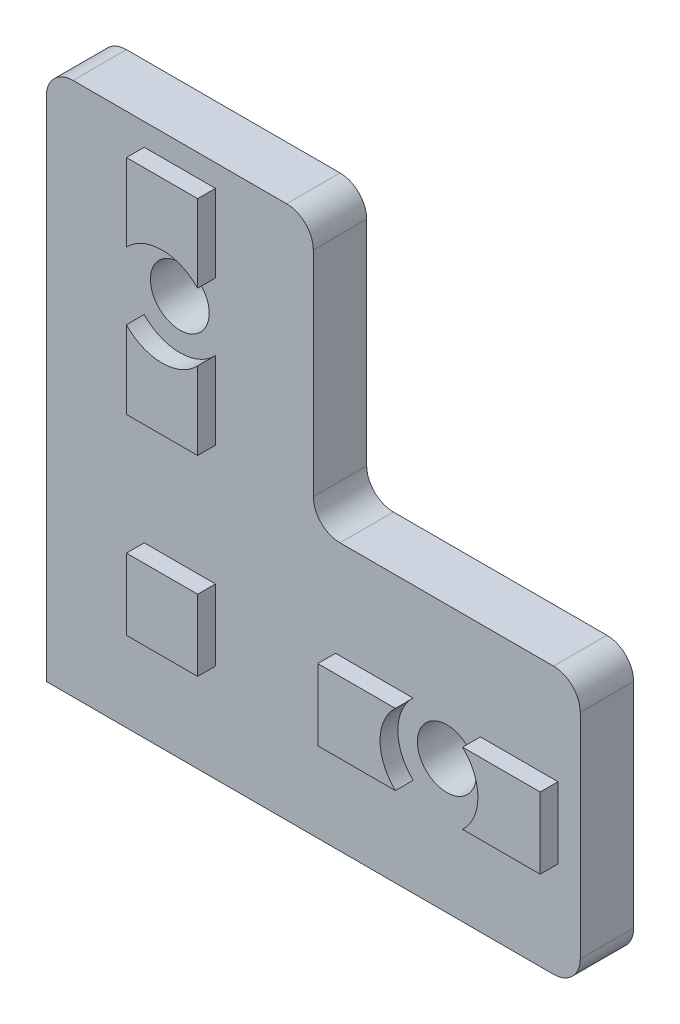
ISO-10303-21;
HEADER;
FILE_DESCRIPTION(('STEP AP214'),'2;1');
FILE_NAME('part.step','',(''),(''),'','','');
FILE_SCHEMA(('AUTOMOTIVE_DESIGN { 1 0 10303 214 1 1 1 1 }'));
ENDSEC;
DATA;
#1=APPLICATION_CONTEXT('core data for automotive mechanical design processes');
#2=APPLICATION_PROTOCOL_DEFINITION('international standard','automotive_design',2000,#1);
#3=PRODUCT_CONTEXT('',#1,'mechanical');
#4=PRODUCT('Part','Part','',(#3));
#5=PRODUCT_RELATED_PRODUCT_CATEGORY('part','',(#4));
#6=PRODUCT_DEFINITION_FORMATION('','',#4);
#7=PRODUCT_DEFINITION_CONTEXT('part definition',#1,'design');
#8=PRODUCT_DEFINITION('design','',#6,#7);
#9=PRODUCT_DEFINITION_SHAPE('','',#8);
#10=(LENGTH_UNIT() NAMED_UNIT(*) SI_UNIT(.MILLI.,.METRE.));
#11=(NAMED_UNIT(*) PLANE_ANGLE_UNIT() SI_UNIT($,.RADIAN.));
#12=(NAMED_UNIT(*) SI_UNIT($,.STERADIAN.) SOLID_ANGLE_UNIT());
#13=UNCERTAINTY_MEASURE_WITH_UNIT(LENGTH_MEASURE(1.E-05),#10,'distance_accuracy_value','');
#14=(GEOMETRIC_REPRESENTATION_CONTEXT(3) GLOBAL_UNCERTAINTY_ASSIGNED_CONTEXT((#13)) GLOBAL_UNIT_ASSIGNED_CONTEXT((#10,
#11,#12)) REPRESENTATION_CONTEXT('',''));
#15=CARTESIAN_POINT('',(0.,0.,0.));
#16=DIRECTION('',(0.,0.,1.));
#17=DIRECTION('',(1.,0.,0.));
#18=AXIS2_PLACEMENT_3D('',#15,#16,#17);
#19=CARTESIAN_POINT('',(0.,57.,6.));
#20=DIRECTION('',(1.,0.,0.));
#21=DIRECTION('',(0.,1.,0.));
#22=AXIS2_PLACEMENT_3D('',#19,#20,#21);
#23=PLANE('',#22);
#24=DIRECTION('',(0.,-1.,0.));
#25=VECTOR('',#24,1.);
#26=CARTESIAN_POINT('',(0.,57.,0.));
#27=LINE('',#26,#25);
#28=CARTESIAN_POINT('',(0.,57.,0.));
#29=VERTEX_POINT('',#28);
#30=CARTESIAN_POINT('',(0.,0.,0.));
#31=VERTEX_POINT('',#30);
#32=EDGE_CURVE('E409',#29,#31,#27,.T.);
#33=ORIENTED_EDGE('',*,*,#32,.T.);
#34=DIRECTION('',(0.,0.,-1.));
#35=VECTOR('',#34,1.);
#36=CARTESIAN_POINT('',(0.,0.,6.));
#37=LINE('',#36,#35);
#38=CARTESIAN_POINT('',(0.,0.,6.));
#39=VERTEX_POINT('',#38);
#40=EDGE_CURVE('E11',#39,#31,#37,.T.);
#41=ORIENTED_EDGE('',*,*,#40,.F.);
#42=DIRECTION('',(0.,-1.,0.));
#43=VECTOR('',#42,1.);
#44=CARTESIAN_POINT('',(0.,57.,6.));
#45=LINE('',#44,#43);
#46=CARTESIAN_POINT('',(0.,57.,6.));
#47=VERTEX_POINT('',#46);
#48=EDGE_CURVE('E410',#47,#39,#45,.T.);
#49=ORIENTED_EDGE('',*,*,#48,.F.);
#50=DIRECTION('',(0.,0.,-1.));
#51=VECTOR('',#50,1.);
#52=CARTESIAN_POINT('',(0.,57.,6.));
#53=LINE('',#52,#51);
#54=EDGE_CURVE('E434',#47,#29,#53,.T.);
#55=ORIENTED_EDGE('',*,*,#54,.T.);
#56=EDGE_LOOP('',(#33,#41,#49,#55));
#57=FACE_BOUND('',#56,.T.);
#58=ADVANCED_FACE('F33',(#57),#23,.F.);
#59=CARTESIAN_POINT('',(0.,0.,6.));
#60=DIRECTION('',(0.,1.,0.));
#61=DIRECTION('',(0.,0.,1.));
#62=AXIS2_PLACEMENT_3D('',#59,#60,#61);
#63=PLANE('',#62);
#64=DIRECTION('',(1.,0.,0.));
#65=VECTOR('',#64,1.);
#66=CARTESIAN_POINT('',(0.,0.,0.));
#67=LINE('',#66,#65);
#68=CARTESIAN_POINT('',(57.,0.,0.));
#69=VERTEX_POINT('',#68);
#70=EDGE_CURVE('E437',#31,#69,#67,.T.);
#71=ORIENTED_EDGE('',*,*,#70,.T.);
#72=DIRECTION('',(0.,0.,-1.));
#73=VECTOR('',#72,1.);
#74=CARTESIAN_POINT('',(57.,0.,6.));
#75=LINE('',#74,#73);
#76=CARTESIAN_POINT('',(57.,0.,6.));
#77=VERTEX_POINT('',#76);
#78=EDGE_CURVE('E40',#77,#69,#75,.T.);
#79=ORIENTED_EDGE('',*,*,#78,.F.);
#80=DIRECTION('',(1.,0.,0.));
#81=VECTOR('',#80,1.);
#82=CARTESIAN_POINT('',(0.,0.,6.));
#83=LINE('',#82,#81);
#84=EDGE_CURVE('E413',#39,#77,#83,.T.);
#85=ORIENTED_EDGE('',*,*,#84,.F.);
#86=ORIENTED_EDGE('',*,*,#40,.T.);
#87=EDGE_LOOP('',(#71,#79,#85,#86));
#88=FACE_BOUND('',#87,.T.);
#89=ADVANCED_FACE('F509',(#88),#63,.F.);
#90=CARTESIAN_POINT('',(57.,3.,6.));
#91=DIRECTION('',(0.,0.,-1.));
#92=DIRECTION('',(-1.,0.,0.));
#93=AXIS2_PLACEMENT_3D('',#90,#91,#92);
#94=CYLINDRICAL_SURFACE('',#93,3.);
#95=CARTESIAN_POINT('',(57.,3.,0.));
#96=DIRECTION('',(0.,0.,1.));
#97=DIRECTION('',(1.,0.,0.));
#98=AXIS2_PLACEMENT_3D('',#95,#96,#97);
#99=CIRCLE('',#98,3.);
#100=CARTESIAN_POINT('',(60.,3.,0.));
#101=VERTEX_POINT('',#100);
#102=EDGE_CURVE('E439',#69,#101,#99,.T.);
#103=ORIENTED_EDGE('',*,*,#102,.T.);
#104=DIRECTION('',(0.,0.,-1.));
#105=VECTOR('',#104,1.);
#106=CARTESIAN_POINT('',(60.,3.,6.));
#107=LINE('',#106,#105);
#108=CARTESIAN_POINT('',(60.,3.,6.));
#109=VERTEX_POINT('',#108);
#110=EDGE_CURVE('E479',#109,#101,#107,.T.);
#111=ORIENTED_EDGE('',*,*,#110,.F.);
#112=CARTESIAN_POINT('',(57.,3.,6.));
#113=DIRECTION('',(0.,0.,1.));
#114=DIRECTION('',(1.,0.,0.));
#115=AXIS2_PLACEMENT_3D('',#112,#113,#114);
#116=CIRCLE('',#115,3.);
#117=EDGE_CURVE('E416',#77,#109,#116,.T.);
#118=ORIENTED_EDGE('',*,*,#117,.F.);
#119=ORIENTED_EDGE('',*,*,#78,.T.);
#120=EDGE_LOOP('',(#103,#111,#118,#119));
#121=FACE_BOUND('',#120,.T.);
#122=ADVANCED_FACE('F486',(#121),#94,.T.);
#123=CARTESIAN_POINT('',(60.,3.00000000000002,6.));
#124=DIRECTION('',(-1.,0.,0.));
#125=DIRECTION('',(0.,0.,1.));
#126=AXIS2_PLACEMENT_3D('',#123,#124,#125);
#127=PLANE('',#126);
#128=DIRECTION('',(0.,1.,0.));
#129=VECTOR('',#128,1.);
#130=CARTESIAN_POINT('',(60.,3.00000000000002,0.));
#131=LINE('',#130,#129);
#132=CARTESIAN_POINT('',(60.,27.,0.));
#133=VERTEX_POINT('',#132);
#134=EDGE_CURVE('E441',#101,#133,#131,.T.);
#135=ORIENTED_EDGE('',*,*,#134,.T.);
#136=DIRECTION('',(0.,0.,-1.));
#137=VECTOR('',#136,1.);
#138=CARTESIAN_POINT('',(60.,27.,6.));
#139=LINE('',#138,#137);
#140=CARTESIAN_POINT('',(60.,27.,6.));
#141=VERTEX_POINT('',#140);
#142=EDGE_CURVE('E476',#141,#133,#139,.T.);
#143=ORIENTED_EDGE('',*,*,#142,.F.);
#144=DIRECTION('',(0.,1.,0.));
#145=VECTOR('',#144,1.);
#146=CARTESIAN_POINT('',(60.,3.00000000000002,6.));
#147=LINE('',#146,#145);
#148=EDGE_CURVE('E418',#109,#141,#147,.T.);
#149=ORIENTED_EDGE('',*,*,#148,.F.);
#150=ORIENTED_EDGE('',*,*,#110,.T.);
#151=EDGE_LOOP('',(#135,#143,#149,#150));
#152=FACE_BOUND('',#151,.T.);
#153=ADVANCED_FACE('F497',(#152),#127,.F.);
#154=CARTESIAN_POINT('',(57.,27.,6.));
#155=DIRECTION('',(0.,0.,-1.));
#156=DIRECTION('',(-1.,0.,0.));
#157=AXIS2_PLACEMENT_3D('',#154,#155,#156);
#158=CYLINDRICAL_SURFACE('',#157,3.);
#159=CARTESIAN_POINT('',(57.,27.,0.));
#160=DIRECTION('',(0.,0.,1.));
#161=DIRECTION('',(1.,0.,0.));
#162=AXIS2_PLACEMENT_3D('',#159,#160,#161);
#163=CIRCLE('',#162,3.);
#164=CARTESIAN_POINT('',(57.,30.,0.));
#165=VERTEX_POINT('',#164);
#166=EDGE_CURVE('E443',#133,#165,#163,.T.);
#167=ORIENTED_EDGE('',*,*,#166,.T.);
#168=DIRECTION('',(0.,0.,-1.));
#169=VECTOR('',#168,1.);
#170=CARTESIAN_POINT('',(57.,30.,6.));
#171=LINE('',#170,#169);
#172=CARTESIAN_POINT('',(57.,30.,6.));
#173=VERTEX_POINT('',#172);
#174=EDGE_CURVE('E473',#173,#165,#171,.T.);
#175=ORIENTED_EDGE('',*,*,#174,.F.);
#176=CARTESIAN_POINT('',(57.,27.,6.));
#177=DIRECTION('',(0.,0.,1.));
#178=DIRECTION('',(1.,0.,0.));
#179=AXIS2_PLACEMENT_3D('',#176,#177,#178);
#180=CIRCLE('',#179,3.);
#181=EDGE_CURVE('E420',#141,#173,#180,.T.);
#182=ORIENTED_EDGE('',*,*,#181,.F.);
#183=ORIENTED_EDGE('',*,*,#142,.T.);
#184=EDGE_LOOP('',(#167,#175,#182,#183));
#185=FACE_BOUND('',#184,.T.);
#186=ADVANCED_FACE('F501',(#185),#158,.T.);
#187=CARTESIAN_POINT('',(57.,30.,6.));
#188=DIRECTION('',(0.,-1.,0.));
#189=DIRECTION('',(1.,0.,0.));
#190=AXIS2_PLACEMENT_3D('',#187,#188,#189);
#191=PLANE('',#190);
#192=DIRECTION('',(-1.,0.,0.));
#193=VECTOR('',#192,1.);
#194=CARTESIAN_POINT('',(57.,30.,0.));
#195=LINE('',#194,#193);
#196=CARTESIAN_POINT('',(33.,30.,0.));
#197=VERTEX_POINT('',#196);
#198=EDGE_CURVE('E445',#165,#197,#195,.T.);
#199=ORIENTED_EDGE('',*,*,#198,.T.);
#200=DIRECTION('',(0.,0.,-1.));
#201=VECTOR('',#200,1.);
#202=CARTESIAN_POINT('',(33.,30.,6.));
#203=LINE('',#202,#201);
#204=CARTESIAN_POINT('',(33.,30.,6.));
#205=VERTEX_POINT('',#204);
#206=EDGE_CURVE('E470',#205,#197,#203,.T.);
#207=ORIENTED_EDGE('',*,*,#206,.F.);
#208=DIRECTION('',(-1.,0.,0.));
#209=VECTOR('',#208,1.);
#210=CARTESIAN_POINT('',(57.,30.,6.));
#211=LINE('',#210,#209);
#212=EDGE_CURVE('E422',#173,#205,#211,.T.);
#213=ORIENTED_EDGE('',*,*,#212,.F.);
#214=ORIENTED_EDGE('',*,*,#174,.T.);
#215=EDGE_LOOP('',(#199,#207,#213,#214));
#216=FACE_BOUND('',#215,.T.);
#217=ADVANCED_FACE('F537',(#216),#191,.F.);
#218=CARTESIAN_POINT('',(33.,33.,6.));
#219=DIRECTION('',(0.,0.,-1.));
#220=DIRECTION('',(-1.,0.,0.));
#221=AXIS2_PLACEMENT_3D('',#218,#219,#220);
#222=CYLINDRICAL_SURFACE('',#221,3.);
#223=CARTESIAN_POINT('',(33.,33.,0.));
#224=DIRECTION('',(0.,0.,-1.));
#225=DIRECTION('',(-1.,0.,0.));
#226=AXIS2_PLACEMENT_3D('',#223,#224,#225);
#227=CIRCLE('',#226,3.);
#228=CARTESIAN_POINT('',(30.,33.,0.));
#229=VERTEX_POINT('',#228);
#230=EDGE_CURVE('E447',#197,#229,#227,.T.);
#231=ORIENTED_EDGE('',*,*,#230,.T.);
#232=DIRECTION('',(0.,0.,-1.));
#233=VECTOR('',#232,1.);
#234=CARTESIAN_POINT('',(30.,33.,6.));
#235=LINE('',#234,#233);
#236=CARTESIAN_POINT('',(30.,33.,6.));
#237=VERTEX_POINT('',#236);
#238=EDGE_CURVE('E467',#237,#229,#235,.T.);
#239=ORIENTED_EDGE('',*,*,#238,.F.);
#240=CARTESIAN_POINT('',(33.,33.,6.));
#241=DIRECTION('',(0.,0.,-1.));
#242=DIRECTION('',(-1.,0.,0.));
#243=AXIS2_PLACEMENT_3D('',#240,#241,#242);
#244=CIRCLE('',#243,3.);
#245=EDGE_CURVE('E424',#205,#237,#244,.T.);
#246=ORIENTED_EDGE('',*,*,#245,.F.);
#247=ORIENTED_EDGE('',*,*,#206,.T.);
#248=EDGE_LOOP('',(#231,#239,#246,#247));
#249=FACE_BOUND('',#248,.T.);
#250=ADVANCED_FACE('F535',(#249),#222,.F.);
#251=CARTESIAN_POINT('',(30.,33.,6.));
#252=DIRECTION('',(-1.,0.,0.));
#253=DIRECTION('',(0.,-1.,0.));
#254=AXIS2_PLACEMENT_3D('',#251,#252,#253);
#255=PLANE('',#254);
#256=DIRECTION('',(0.,1.,0.));
#257=VECTOR('',#256,1.);
#258=CARTESIAN_POINT('',(30.,33.,0.));
#259=LINE('',#258,#257);
#260=CARTESIAN_POINT('',(30.,57.,0.));
#261=VERTEX_POINT('',#260);
#262=EDGE_CURVE('E449',#229,#261,#259,.T.);
#263=ORIENTED_EDGE('',*,*,#262,.T.);
#264=DIRECTION('',(0.,0.,-1.));
#265=VECTOR('',#264,1.);
#266=CARTESIAN_POINT('',(30.,57.,6.));
#267=LINE('',#266,#265);
#268=CARTESIAN_POINT('',(30.,57.,6.));
#269=VERTEX_POINT('',#268);
#270=EDGE_CURVE('E464',#269,#261,#267,.T.);
#271=ORIENTED_EDGE('',*,*,#270,.F.);
#272=DIRECTION('',(0.,1.,0.));
#273=VECTOR('',#272,1.);
#274=CARTESIAN_POINT('',(30.,33.,6.));
#275=LINE('',#274,#273);
#276=EDGE_CURVE('E426',#237,#269,#275,.T.);
#277=ORIENTED_EDGE('',*,*,#276,.F.);
#278=ORIENTED_EDGE('',*,*,#238,.T.);
#279=EDGE_LOOP('',(#263,#271,#277,#278));
#280=FACE_BOUND('',#279,.T.);
#281=ADVANCED_FACE('F530',(#280),#255,.F.);
#282=CARTESIAN_POINT('',(27.,57.,6.));
#283=DIRECTION('',(0.,0.,-1.));
#284=DIRECTION('',(-1.,0.,0.));
#285=AXIS2_PLACEMENT_3D('',#282,#283,#284);
#286=CYLINDRICAL_SURFACE('',#285,3.);
#287=CARTESIAN_POINT('',(27.,57.,0.));
#288=DIRECTION('',(0.,0.,1.));
#289=DIRECTION('',(1.,0.,0.));
#290=AXIS2_PLACEMENT_3D('',#287,#288,#289);
#291=CIRCLE('',#290,3.);
#292=CARTESIAN_POINT('',(27.,60.,0.));
#293=VERTEX_POINT('',#292);
#294=EDGE_CURVE('E451',#261,#293,#291,.T.);
#295=ORIENTED_EDGE('',*,*,#294,.T.);
#296=DIRECTION('',(0.,0.,-1.));
#297=VECTOR('',#296,1.);
#298=CARTESIAN_POINT('',(27.,60.,6.));
#299=LINE('',#298,#297);
#300=CARTESIAN_POINT('',(27.,60.,6.));
#301=VERTEX_POINT('',#300);
#302=EDGE_CURVE('E461',#301,#293,#299,.T.);
#303=ORIENTED_EDGE('',*,*,#302,.F.);
#304=CARTESIAN_POINT('',(27.,57.,6.));
#305=DIRECTION('',(0.,0.,1.));
#306=DIRECTION('',(1.,0.,0.));
#307=AXIS2_PLACEMENT_3D('',#304,#305,#306);
#308=CIRCLE('',#307,3.);
#309=EDGE_CURVE('E428',#269,#301,#308,.T.);
#310=ORIENTED_EDGE('',*,*,#309,.F.);
#311=ORIENTED_EDGE('',*,*,#270,.T.);
#312=EDGE_LOOP('',(#295,#303,#310,#311));
#313=FACE_BOUND('',#312,.T.);
#314=ADVANCED_FACE('F525',(#313),#286,.T.);
#315=CARTESIAN_POINT('',(27.,60.,6.));
#316=DIRECTION('',(0.,-1.,0.));
#317=DIRECTION('',(0.,0.,-1.));
#318=AXIS2_PLACEMENT_3D('',#315,#316,#317);
#319=PLANE('',#318);
#320=DIRECTION('',(-1.,0.,0.));
#321=VECTOR('',#320,1.);
#322=CARTESIAN_POINT('',(27.,60.,0.));
#323=LINE('',#322,#321);
#324=CARTESIAN_POINT('',(3.00000000000003,60.,0.));
#325=VERTEX_POINT('',#324);
#326=EDGE_CURVE('E453',#293,#325,#323,.T.);
#327=ORIENTED_EDGE('',*,*,#326,.T.);
#328=DIRECTION('',(0.,0.,-1.));
#329=VECTOR('',#328,1.);
#330=CARTESIAN_POINT('',(3.00000000000003,60.,6.));
#331=LINE('',#330,#329);
#332=CARTESIAN_POINT('',(3.00000000000003,60.,6.));
#333=VERTEX_POINT('',#332);
#334=EDGE_CURVE('E458',#333,#325,#331,.T.);
#335=ORIENTED_EDGE('',*,*,#334,.F.);
#336=DIRECTION('',(-1.,0.,0.));
#337=VECTOR('',#336,1.);
#338=CARTESIAN_POINT('',(27.,60.,6.));
#339=LINE('',#338,#337);
#340=EDGE_CURVE('E430',#301,#333,#339,.T.);
#341=ORIENTED_EDGE('',*,*,#340,.F.);
#342=ORIENTED_EDGE('',*,*,#302,.T.);
#343=EDGE_LOOP('',(#327,#335,#341,#342));
#344=FACE_BOUND('',#343,.T.);
#345=ADVANCED_FACE('F521',(#344),#319,.F.);
#346=CARTESIAN_POINT('',(3.,57.,6.));
#347=DIRECTION('',(0.,0.,-1.));
#348=DIRECTION('',(-1.,0.,0.));
#349=AXIS2_PLACEMENT_3D('',#346,#347,#348);
#350=CYLINDRICAL_SURFACE('',#349,3.);
#351=CARTESIAN_POINT('',(3.,57.,0.));
#352=DIRECTION('',(0.,0.,1.));
#353=DIRECTION('',(1.,0.,0.));
#354=AXIS2_PLACEMENT_3D('',#351,#352,#353);
#355=CIRCLE('',#354,3.);
#356=EDGE_CURVE('E414',#325,#29,#355,.T.);
#357=ORIENTED_EDGE('',*,*,#356,.T.);
#358=ORIENTED_EDGE('',*,*,#54,.F.);
#359=CARTESIAN_POINT('',(3.,57.,6.));
#360=DIRECTION('',(0.,0.,1.));
#361=DIRECTION('',(1.,0.,0.));
#362=AXIS2_PLACEMENT_3D('',#359,#360,#361);
#363=CIRCLE('',#362,3.);
#364=EDGE_CURVE('E432',#333,#47,#363,.T.);
#365=ORIENTED_EDGE('',*,*,#364,.F.);
#366=ORIENTED_EDGE('',*,*,#334,.T.);
#367=EDGE_LOOP('',(#357,#358,#365,#366));
#368=FACE_BOUND('',#367,.T.);
#369=ADVANCED_FACE('F516',(#368),#350,.T.);
#370=CARTESIAN_POINT('',(57.,3.,6.));
#371=DIRECTION('',(0.,0.,1.));
#372=DIRECTION('',(1.,0.,0.));
#373=AXIS2_PLACEMENT_3D('',#370,#371,#372);
#374=PLANE('',#373);
#375=DIRECTION('',(0.,-1.,0.));
#376=VECTOR('',#375,1.);
#377=CARTESIAN_POINT('',(19.,0.,6.));
#378=LINE('',#377,#376);
#379=CARTESIAN_POINT('',(19.,19.,6.));
#380=VERTEX_POINT('',#379);
#381=CARTESIAN_POINT('',(19.,11.,6.));
#382=VERTEX_POINT('',#381);
#383=EDGE_CURVE('E242',#380,#382,#378,.T.);
#384=ORIENTED_EDGE('',*,*,#383,.T.);
#385=DIRECTION('',(1.,0.,0.));
#386=VECTOR('',#385,1.);
#387=CARTESIAN_POINT('',(0.,11.,6.));
#388=LINE('',#387,#386);
#389=CARTESIAN_POINT('',(11.,11.,6.));
#390=VERTEX_POINT('',#389);
#391=EDGE_CURVE('E256',#390,#382,#388,.T.);
#392=ORIENTED_EDGE('',*,*,#391,.F.);
#393=DIRECTION('',(0.,-1.,0.));
#394=VECTOR('',#393,1.);
#395=CARTESIAN_POINT('',(11.,0.,6.));
#396=LINE('',#395,#394);
#397=CARTESIAN_POINT('',(11.,19.,6.));
#398=VERTEX_POINT('',#397);
#399=EDGE_CURVE('E269',#398,#390,#396,.T.);
#400=ORIENTED_EDGE('',*,*,#399,.F.);
#401=DIRECTION('',(1.,0.,0.));
#402=VECTOR('',#401,1.);
#403=CARTESIAN_POINT('',(0.,19.,6.));
#404=LINE('',#403,#402);
#405=EDGE_CURVE('E267',#398,#380,#404,.T.);
#406=ORIENTED_EDGE('',*,*,#405,.T.);
#407=EDGE_LOOP('',(#384,#392,#400,#406));
#408=FACE_BOUND('',#407,.T.);
#409=CARTESIAN_POINT('',(45.,15.,6.));
#410=DIRECTION('',(0.,0.,1.));
#411=DIRECTION('',(1.,0.,0.));
#412=AXIS2_PLACEMENT_3D('',#409,#410,#411);
#413=CIRCLE('',#412,5.5);
#414=CARTESIAN_POINT('',(48.7749172176354,11.,6.));
#415=VERTEX_POINT('',#414);
#416=CARTESIAN_POINT('',(48.7749172176354,19.,6.));
#417=VERTEX_POINT('',#416);
#418=EDGE_CURVE('E247',#415,#417,#413,.T.);
#419=ORIENTED_EDGE('',*,*,#418,.T.);
#420=DIRECTION('',(1.,0.,0.));
#421=VECTOR('',#420,1.);
#422=CARTESIAN_POINT('',(0.,19.,6.));
#423=LINE('',#422,#421);
#424=CARTESIAN_POINT('',(57.5,19.,6.));
#425=VERTEX_POINT('',#424);
#426=EDGE_CURVE('E279',#417,#425,#423,.T.);
#427=ORIENTED_EDGE('',*,*,#426,.T.);
#428=DIRECTION('',(0.,-1.,0.));
#429=VECTOR('',#428,1.);
#430=CARTESIAN_POINT('',(57.5,0.,6.));
#431=LINE('',#430,#429);
#432=CARTESIAN_POINT('',(57.5,11.,6.));
#433=VERTEX_POINT('',#432);
#434=EDGE_CURVE('E290',#425,#433,#431,.T.);
#435=ORIENTED_EDGE('',*,*,#434,.T.);
#436=DIRECTION('',(1.,0.,0.));
#437=VECTOR('',#436,1.);
#438=CARTESIAN_POINT('',(0.,11.,6.));
#439=LINE('',#438,#437);
#440=EDGE_CURVE('E55',#415,#433,#439,.T.);
#441=ORIENTED_EDGE('',*,*,#440,.F.);
#442=EDGE_LOOP('',(#419,#427,#435,#441));
#443=FACE_BOUND('',#442,.T.);
#444=CARTESIAN_POINT('',(45.,15.,6.));
#445=DIRECTION('',(0.,0.,1.));
#446=DIRECTION('',(1.,0.,0.));
#447=AXIS2_PLACEMENT_3D('',#444,#445,#446);
#448=CIRCLE('',#447,5.5);
#449=CARTESIAN_POINT('',(41.2250827823646,19.,6.));
#450=VERTEX_POINT('',#449);
#451=CARTESIAN_POINT('',(41.2250827823646,11.,6.));
#452=VERTEX_POINT('',#451);
#453=EDGE_CURVE('E303',#450,#452,#448,.T.);
#454=ORIENTED_EDGE('',*,*,#453,.T.);
#455=DIRECTION('',(1.,0.,0.));
#456=VECTOR('',#455,1.);
#457=CARTESIAN_POINT('',(0.,11.,6.));
#458=LINE('',#457,#456);
#459=CARTESIAN_POINT('',(32.5,11.,6.));
#460=VERTEX_POINT('',#459);
#461=EDGE_CURVE('E308',#460,#452,#458,.T.);
#462=ORIENTED_EDGE('',*,*,#461,.F.);
#463=DIRECTION('',(0.,-1.,0.));
#464=VECTOR('',#463,1.);
#465=CARTESIAN_POINT('',(32.5,0.,6.));
#466=LINE('',#465,#464);
#467=CARTESIAN_POINT('',(32.5,19.,6.));
#468=VERTEX_POINT('',#467);
#469=EDGE_CURVE('E321',#468,#460,#466,.T.);
#470=ORIENTED_EDGE('',*,*,#469,.F.);
#471=DIRECTION('',(1.,0.,0.));
#472=VECTOR('',#471,1.);
#473=CARTESIAN_POINT('',(0.,19.,6.));
#474=LINE('',#473,#472);
#475=EDGE_CURVE('E318',#468,#450,#474,.T.);
#476=ORIENTED_EDGE('',*,*,#475,.T.);
#477=EDGE_LOOP('',(#454,#462,#470,#476));
#478=FACE_BOUND('',#477,.T.);
#479=CARTESIAN_POINT('',(15.,45.,6.));
#480=DIRECTION('',(0.,0.,1.));
#481=DIRECTION('',(1.,0.,0.));
#482=AXIS2_PLACEMENT_3D('',#479,#480,#481);
#483=CIRCLE('',#482,5.5);
#484=CARTESIAN_POINT('',(19.,48.7749172176354,6.));
#485=VERTEX_POINT('',#484);
#486=CARTESIAN_POINT('',(11.,48.7749172176354,6.));
#487=VERTEX_POINT('',#486);
#488=EDGE_CURVE('E333',#485,#487,#483,.T.);
#489=ORIENTED_EDGE('',*,*,#488,.T.);
#490=DIRECTION('',(0.,-1.,0.));
#491=VECTOR('',#490,1.);
#492=CARTESIAN_POINT('',(11.,0.,6.));
#493=LINE('',#492,#491);
#494=CARTESIAN_POINT('',(11.,57.5,6.));
#495=VERTEX_POINT('',#494);
#496=EDGE_CURVE('E338',#495,#487,#493,.T.);
#497=ORIENTED_EDGE('',*,*,#496,.F.);
#498=DIRECTION('',(1.,0.,0.));
#499=VECTOR('',#498,1.);
#500=CARTESIAN_POINT('',(0.,57.5,6.));
#501=LINE('',#500,#499);
#502=CARTESIAN_POINT('',(19.,57.5,6.));
#503=VERTEX_POINT('',#502);
#504=EDGE_CURVE('E352',#495,#503,#501,.T.);
#505=ORIENTED_EDGE('',*,*,#504,.T.);
#506=DIRECTION('',(0.,-1.,0.));
#507=VECTOR('',#506,1.);
#508=CARTESIAN_POINT('',(19.,0.,6.));
#509=LINE('',#508,#507);
#510=EDGE_CURVE('E349',#503,#485,#509,.T.);
#511=ORIENTED_EDGE('',*,*,#510,.T.);
#512=EDGE_LOOP('',(#489,#497,#505,#511));
#513=FACE_BOUND('',#512,.T.);
#514=CARTESIAN_POINT('',(15.,45.,6.));
#515=DIRECTION('',(0.,0.,1.));
#516=DIRECTION('',(1.,0.,0.));
#517=AXIS2_PLACEMENT_3D('',#514,#515,#516);
#518=CIRCLE('',#517,5.5);
#519=CARTESIAN_POINT('',(11.,41.2250827823646,6.));
#520=VERTEX_POINT('',#519);
#521=CARTESIAN_POINT('',(19.,41.2250827823646,6.));
#522=VERTEX_POINT('',#521);
#523=EDGE_CURVE('E365',#520,#522,#518,.T.);
#524=ORIENTED_EDGE('',*,*,#523,.T.);
#525=DIRECTION('',(0.,-1.,0.));
#526=VECTOR('',#525,1.);
#527=CARTESIAN_POINT('',(19.,0.,6.));
#528=LINE('',#527,#526);
#529=CARTESIAN_POINT('',(19.,32.5,6.));
#530=VERTEX_POINT('',#529);
#531=EDGE_CURVE('E370',#522,#530,#528,.T.);
#532=ORIENTED_EDGE('',*,*,#531,.T.);
#533=DIRECTION('',(1.,0.,0.));
#534=VECTOR('',#533,1.);
#535=CARTESIAN_POINT('',(0.,32.5,6.));
#536=LINE('',#535,#534);
#537=CARTESIAN_POINT('',(11.,32.5,6.));
#538=VERTEX_POINT('',#537);
#539=EDGE_CURVE('E382',#538,#530,#536,.T.);
#540=ORIENTED_EDGE('',*,*,#539,.F.);
#541=DIRECTION('',(0.,-1.,0.));
#542=VECTOR('',#541,1.);
#543=CARTESIAN_POINT('',(11.,0.,6.));
#544=LINE('',#543,#542);
#545=EDGE_CURVE('E379',#520,#538,#544,.T.);
#546=ORIENTED_EDGE('',*,*,#545,.F.);
#547=EDGE_LOOP('',(#524,#532,#540,#546));
#548=FACE_BOUND('',#547,.T.);
#549=CARTESIAN_POINT('',(45.,15.,6.));
#550=DIRECTION('',(0.,0.,1.));
#551=DIRECTION('',(1.,0.,0.));
#552=AXIS2_PLACEMENT_3D('',#549,#550,#551);
#553=CIRCLE('',#552,3.3);
#554=CARTESIAN_POINT('',(48.3,15.,6.));
#555=VERTEX_POINT('',#554);
#556=EDGE_CURVE('E397',#555,#555,#553,.T.);
#557=ORIENTED_EDGE('',*,*,#556,.F.);
#558=EDGE_LOOP('',(#557));
#559=FACE_BOUND('',#558,.T.);
#560=CARTESIAN_POINT('',(15.,45.,6.));
#561=DIRECTION('',(0.,0.,1.));
#562=DIRECTION('',(1.,0.,0.));
#563=AXIS2_PLACEMENT_3D('',#560,#561,#562);
#564=CIRCLE('',#563,3.3);
#565=CARTESIAN_POINT('',(18.3,45.,6.));
#566=VERTEX_POINT('',#565);
#567=EDGE_CURVE('E403',#566,#566,#564,.T.);
#568=ORIENTED_EDGE('',*,*,#567,.F.);
#569=EDGE_LOOP('',(#568));
#570=FACE_BOUND('',#569,.T.);
#571=ORIENTED_EDGE('',*,*,#48,.T.);
#572=ORIENTED_EDGE('',*,*,#84,.T.);
#573=ORIENTED_EDGE('',*,*,#117,.T.);
#574=ORIENTED_EDGE('',*,*,#148,.T.);
#575=ORIENTED_EDGE('',*,*,#181,.T.);
#576=ORIENTED_EDGE('',*,*,#212,.T.);
#577=ORIENTED_EDGE('',*,*,#245,.T.);
#578=ORIENTED_EDGE('',*,*,#276,.T.);
#579=ORIENTED_EDGE('',*,*,#309,.T.);
#580=ORIENTED_EDGE('',*,*,#340,.T.);
#581=ORIENTED_EDGE('',*,*,#364,.T.);
#582=EDGE_LOOP('',(#571,#572,#573,#574,#575,#576,#577,#578,#579,#580,#581));
#583=FACE_BOUND('',#582,.T.);
#584=ADVANCED_FACE('F505',(#408,#443,#478,#513,#548,#559,#570,#583),#374,.T.);
#585=CARTESIAN_POINT('',(57.,3.,0.));
#586=DIRECTION('',(0.,0.,1.));
#587=DIRECTION('',(1.,0.,0.));
#588=AXIS2_PLACEMENT_3D('',#585,#586,#587);
#589=PLANE('',#588);
#590=CARTESIAN_POINT('',(45.,15.,0.));
#591=DIRECTION('',(0.,0.,1.));
#592=DIRECTION('',(1.,0.,0.));
#593=AXIS2_PLACEMENT_3D('',#590,#591,#592);
#594=CIRCLE('',#593,3.3);
#595=CARTESIAN_POINT('',(48.3,15.,0.));
#596=VERTEX_POINT('',#595);
#597=EDGE_CURVE('E400',#596,#596,#594,.T.);
#598=ORIENTED_EDGE('',*,*,#597,.T.);
#599=EDGE_LOOP('',(#598));
#600=FACE_BOUND('',#599,.T.);
#601=CARTESIAN_POINT('',(15.,45.,0.));
#602=DIRECTION('',(0.,0.,1.));
#603=DIRECTION('',(1.,0.,0.));
#604=AXIS2_PLACEMENT_3D('',#601,#602,#603);
#605=CIRCLE('',#604,3.3);
#606=CARTESIAN_POINT('',(18.3,45.,0.));
#607=VERTEX_POINT('',#606);
#608=EDGE_CURVE('E406',#607,#607,#605,.T.);
#609=ORIENTED_EDGE('',*,*,#608,.T.);
#610=EDGE_LOOP('',(#609));
#611=FACE_BOUND('',#610,.T.);
#612=ORIENTED_EDGE('',*,*,#32,.F.);
#613=ORIENTED_EDGE('',*,*,#356,.F.);
#614=ORIENTED_EDGE('',*,*,#326,.F.);
#615=ORIENTED_EDGE('',*,*,#294,.F.);
#616=ORIENTED_EDGE('',*,*,#262,.F.);
#617=ORIENTED_EDGE('',*,*,#230,.F.);
#618=ORIENTED_EDGE('',*,*,#198,.F.);
#619=ORIENTED_EDGE('',*,*,#166,.F.);
#620=ORIENTED_EDGE('',*,*,#134,.F.);
#621=ORIENTED_EDGE('',*,*,#102,.F.);
#622=ORIENTED_EDGE('',*,*,#70,.F.);
#623=EDGE_LOOP('',(#612,#613,#614,#615,#616,#617,#618,#619,#620,#621,#622));
#624=FACE_BOUND('',#623,.T.);
#625=ADVANCED_FACE('F492',(#600,#611,#624),#589,.F.);
#626=CARTESIAN_POINT('',(15.,45.,6.));
#627=DIRECTION('',(0.,0.,1.));
#628=DIRECTION('',(1.,0.,0.));
#629=AXIS2_PLACEMENT_3D('',#626,#627,#628);
#630=CYLINDRICAL_SURFACE('',#629,3.3);
#631=ORIENTED_EDGE('',*,*,#608,.F.);
#632=EDGE_LOOP('',(#631));
#633=FACE_BOUND('',#632,.T.);
#634=ORIENTED_EDGE('',*,*,#567,.T.);
#635=EDGE_LOOP('',(#634));
#636=FACE_BOUND('',#635,.T.);
#637=ADVANCED_FACE('F617',(#633,#636),#630,.F.);
#638=CARTESIAN_POINT('',(45.,15.,6.));
#639=DIRECTION('',(0.,0.,1.));
#640=DIRECTION('',(1.,0.,0.));
#641=AXIS2_PLACEMENT_3D('',#638,#639,#640);
#642=CYLINDRICAL_SURFACE('',#641,3.3);
#643=ORIENTED_EDGE('',*,*,#597,.F.);
#644=EDGE_LOOP('',(#643));
#645=FACE_BOUND('',#644,.T.);
#646=ORIENTED_EDGE('',*,*,#556,.T.);
#647=EDGE_LOOP('',(#646));
#648=FACE_BOUND('',#647,.T.);
#649=ADVANCED_FACE('F627',(#645,#648),#642,.F.);
#650=CARTESIAN_POINT('',(15.,45.,8.));
#651=DIRECTION('',(0.,0.,-1.));
#652=DIRECTION('',(-1.,0.,0.));
#653=AXIS2_PLACEMENT_3D('',#650,#651,#652);
#654=CYLINDRICAL_SURFACE('',#653,5.5);
#655=ORIENTED_EDGE('',*,*,#523,.F.);
#656=DIRECTION('',(0.,0.,-1.));
#657=VECTOR('',#656,1.);
#658=CARTESIAN_POINT('',(11.,41.2250827823646,8.));
#659=LINE('',#658,#657);
#660=CARTESIAN_POINT('',(11.,41.2250827823646,8.));
#661=VERTEX_POINT('',#660);
#662=EDGE_CURVE('E394',#661,#520,#659,.T.);
#663=ORIENTED_EDGE('',*,*,#662,.F.);
#664=CARTESIAN_POINT('',(15.,45.,8.));
#665=DIRECTION('',(0.,0.,1.));
#666=DIRECTION('',(1.,0.,0.));
#667=AXIS2_PLACEMENT_3D('',#664,#665,#666);
#668=CIRCLE('',#667,5.5);
#669=CARTESIAN_POINT('',(19.,41.2250827823646,8.));
#670=VERTEX_POINT('',#669);
#671=EDGE_CURVE('E366',#661,#670,#668,.T.);
#672=ORIENTED_EDGE('',*,*,#671,.T.);
#673=DIRECTION('',(0.,0.,-1.));
#674=VECTOR('',#673,1.);
#675=CARTESIAN_POINT('',(19.,41.2250827823646,8.));
#676=LINE('',#675,#674);
#677=EDGE_CURVE('E377',#670,#522,#676,.T.);
#678=ORIENTED_EDGE('',*,*,#677,.T.);
#679=EDGE_LOOP('',(#655,#663,#672,#678));
#680=FACE_BOUND('',#679,.T.);
#681=ADVANCED_FACE('F637',(#680),#654,.F.);
#682=CARTESIAN_POINT('',(11.,0.,8.));
#683=DIRECTION('',(1.,0.,0.));
#684=DIRECTION('',(0.,1.,0.));
#685=AXIS2_PLACEMENT_3D('',#682,#683,#684);
#686=PLANE('',#685);
#687=ORIENTED_EDGE('',*,*,#545,.T.);
#688=DIRECTION('',(0.,0.,-1.));
#689=VECTOR('',#688,1.);
#690=CARTESIAN_POINT('',(11.,32.5,8.));
#691=LINE('',#690,#689);
#692=CARTESIAN_POINT('',(11.,32.5,8.));
#693=VERTEX_POINT('',#692);
#694=EDGE_CURVE('E391',#693,#538,#691,.T.);
#695=ORIENTED_EDGE('',*,*,#694,.F.);
#696=DIRECTION('',(0.,-1.,0.));
#697=VECTOR('',#696,1.);
#698=CARTESIAN_POINT('',(11.,0.,8.));
#699=LINE('',#698,#697);
#700=EDGE_CURVE('E369',#661,#693,#699,.T.);
#701=ORIENTED_EDGE('',*,*,#700,.F.);
#702=ORIENTED_EDGE('',*,*,#662,.T.);
#703=EDGE_LOOP('',(#687,#695,#701,#702));
#704=FACE_BOUND('',#703,.T.);
#705=ADVANCED_FACE('F652',(#704),#686,.F.);
#706=CARTESIAN_POINT('',(0.,32.5,8.));
#707=DIRECTION('',(0.,1.,0.));
#708=DIRECTION('',(0.,0.,1.));
#709=AXIS2_PLACEMENT_3D('',#706,#707,#708);
#710=PLANE('',#709);
#711=ORIENTED_EDGE('',*,*,#539,.T.);
#712=DIRECTION('',(0.,0.,-1.));
#713=VECTOR('',#712,1.);
#714=CARTESIAN_POINT('',(19.,32.5,8.));
#715=LINE('',#714,#713);
#716=CARTESIAN_POINT('',(19.,32.5,8.));
#717=VERTEX_POINT('',#716);
#718=EDGE_CURVE('E388',#717,#530,#715,.T.);
#719=ORIENTED_EDGE('',*,*,#718,.F.);
#720=DIRECTION('',(1.,0.,0.));
#721=VECTOR('',#720,1.);
#722=CARTESIAN_POINT('',(0.,32.5,8.));
#723=LINE('',#722,#721);
#724=EDGE_CURVE('E372',#693,#717,#723,.T.);
#725=ORIENTED_EDGE('',*,*,#724,.F.);
#726=ORIENTED_EDGE('',*,*,#694,.T.);
#727=EDGE_LOOP('',(#711,#719,#725,#726));
#728=FACE_BOUND('',#727,.T.);
#729=ADVANCED_FACE('F662',(#728),#710,.F.);
#730=CARTESIAN_POINT('',(19.,0.,8.));
#731=DIRECTION('',(1.,0.,0.));
#732=DIRECTION('',(0.,0.,-1.));
#733=AXIS2_PLACEMENT_3D('',#730,#731,#732);
#734=PLANE('',#733);
#735=ORIENTED_EDGE('',*,*,#531,.F.);
#736=ORIENTED_EDGE('',*,*,#677,.F.);
#737=DIRECTION('',(0.,-1.,0.));
#738=VECTOR('',#737,1.);
#739=CARTESIAN_POINT('',(19.,0.,8.));
#740=LINE('',#739,#738);
#741=EDGE_CURVE('E374',#670,#717,#740,.T.);
#742=ORIENTED_EDGE('',*,*,#741,.T.);
#743=ORIENTED_EDGE('',*,*,#718,.T.);
#744=EDGE_LOOP('',(#735,#736,#742,#743));
#745=FACE_BOUND('',#744,.T.);
#746=ADVANCED_FACE('F672',(#745),#734,.T.);
#747=CARTESIAN_POINT('',(0.,0.,8.));
#748=DIRECTION('',(0.,0.,1.));
#749=DIRECTION('',(1.,0.,0.));
#750=AXIS2_PLACEMENT_3D('',#747,#748,#749);
#751=PLANE('',#750);
#752=ORIENTED_EDGE('',*,*,#671,.F.);
#753=ORIENTED_EDGE('',*,*,#700,.T.);
#754=ORIENTED_EDGE('',*,*,#724,.T.);
#755=ORIENTED_EDGE('',*,*,#741,.F.);
#756=EDGE_LOOP('',(#752,#753,#754,#755));
#757=FACE_BOUND('',#756,.T.);
#758=ADVANCED_FACE('F682',(#757),#751,.T.);
#759=CARTESIAN_POINT('',(15.,45.,8.));
#760=DIRECTION('',(0.,0.,-1.));
#761=DIRECTION('',(-1.,0.,0.));
#762=AXIS2_PLACEMENT_3D('',#759,#760,#761);
#763=CYLINDRICAL_SURFACE('',#762,5.5);
#764=ORIENTED_EDGE('',*,*,#488,.F.);
#765=DIRECTION('',(0.,0.,-1.));
#766=VECTOR('',#765,1.);
#767=CARTESIAN_POINT('',(19.,48.7749172176354,8.));
#768=LINE('',#767,#766);
#769=CARTESIAN_POINT('',(19.,48.7749172176354,8.));
#770=VERTEX_POINT('',#769);
#771=EDGE_CURVE('E363',#770,#485,#768,.T.);
#772=ORIENTED_EDGE('',*,*,#771,.F.);
#773=CARTESIAN_POINT('',(15.,45.,8.));
#774=DIRECTION('',(0.,0.,1.));
#775=DIRECTION('',(1.,0.,0.));
#776=AXIS2_PLACEMENT_3D('',#773,#774,#775);
#777=CIRCLE('',#776,5.5);
#778=CARTESIAN_POINT('',(11.,48.7749172176354,8.));
#779=VERTEX_POINT('',#778);
#780=EDGE_CURVE('E334',#770,#779,#777,.T.);
#781=ORIENTED_EDGE('',*,*,#780,.T.);
#782=DIRECTION('',(0.,0.,-1.));
#783=VECTOR('',#782,1.);
#784=CARTESIAN_POINT('',(11.,48.7749172176354,8.));
#785=LINE('',#784,#783);
#786=EDGE_CURVE('E346',#779,#487,#785,.T.);
#787=ORIENTED_EDGE('',*,*,#786,.T.);
#788=EDGE_LOOP('',(#764,#772,#781,#787));
#789=FACE_BOUND('',#788,.T.);
#790=ADVANCED_FACE('F692',(#789),#763,.F.);
#791=CARTESIAN_POINT('',(19.,0.,8.));
#792=DIRECTION('',(1.,0.,0.));
#793=DIRECTION('',(0.,0.,-1.));
#794=AXIS2_PLACEMENT_3D('',#791,#792,#793);
#795=PLANE('',#794);
#796=ORIENTED_EDGE('',*,*,#510,.F.);
#797=DIRECTION('',(0.,0.,-1.));
#798=VECTOR('',#797,1.);
#799=CARTESIAN_POINT('',(19.,57.5,8.));
#800=LINE('',#799,#798);
#801=CARTESIAN_POINT('',(19.,57.5,8.));
#802=VERTEX_POINT('',#801);
#803=EDGE_CURVE('E361',#802,#503,#800,.T.);
#804=ORIENTED_EDGE('',*,*,#803,.F.);
#805=DIRECTION('',(0.,-1.,0.));
#806=VECTOR('',#805,1.);
#807=CARTESIAN_POINT('',(19.,0.,8.));
#808=LINE('',#807,#806);
#809=EDGE_CURVE('E337',#802,#770,#808,.T.);
#810=ORIENTED_EDGE('',*,*,#809,.T.);
#811=ORIENTED_EDGE('',*,*,#771,.T.);
#812=EDGE_LOOP('',(#796,#804,#810,#811));
#813=FACE_BOUND('',#812,.T.);
#814=ADVANCED_FACE('F702',(#813),#795,.T.);
#815=CARTESIAN_POINT('',(0.,57.5,8.));
#816=DIRECTION('',(0.,1.,0.));
#817=DIRECTION('',(0.,0.,1.));
#818=AXIS2_PLACEMENT_3D('',#815,#816,#817);
#819=PLANE('',#818);
#820=ORIENTED_EDGE('',*,*,#504,.F.);
#821=DIRECTION('',(0.,0.,-1.));
#822=VECTOR('',#821,1.);
#823=CARTESIAN_POINT('',(11.,57.5,8.));
#824=LINE('',#823,#822);
#825=CARTESIAN_POINT('',(11.,57.5,8.));
#826=VERTEX_POINT('',#825);
#827=EDGE_CURVE('E358',#826,#495,#824,.T.);
#828=ORIENTED_EDGE('',*,*,#827,.F.);
#829=DIRECTION('',(1.,0.,0.));
#830=VECTOR('',#829,1.);
#831=CARTESIAN_POINT('',(0.,57.5,8.));
#832=LINE('',#831,#830);
#833=EDGE_CURVE('E341',#826,#802,#832,.T.);
#834=ORIENTED_EDGE('',*,*,#833,.T.);
#835=ORIENTED_EDGE('',*,*,#803,.T.);
#836=EDGE_LOOP('',(#820,#828,#834,#835));
#837=FACE_BOUND('',#836,.T.);
#838=ADVANCED_FACE('F712',(#837),#819,.T.);
#839=CARTESIAN_POINT('',(11.,0.,8.));
#840=DIRECTION('',(1.,0.,0.));
#841=DIRECTION('',(0.,1.,0.));
#842=AXIS2_PLACEMENT_3D('',#839,#840,#841);
#843=PLANE('',#842);
#844=ORIENTED_EDGE('',*,*,#496,.T.);
#845=ORIENTED_EDGE('',*,*,#786,.F.);
#846=DIRECTION('',(0.,-1.,0.));
#847=VECTOR('',#846,1.);
#848=CARTESIAN_POINT('',(11.,0.,8.));
#849=LINE('',#848,#847);
#850=EDGE_CURVE('E344',#826,#779,#849,.T.);
#851=ORIENTED_EDGE('',*,*,#850,.F.);
#852=ORIENTED_EDGE('',*,*,#827,.T.);
#853=EDGE_LOOP('',(#844,#845,#851,#852));
#854=FACE_BOUND('',#853,.T.);
#855=ADVANCED_FACE('F722',(#854),#843,.F.);
#856=CARTESIAN_POINT('',(0.,0.,8.));
#857=DIRECTION('',(0.,0.,1.));
#858=DIRECTION('',(1.,0.,0.));
#859=AXIS2_PLACEMENT_3D('',#856,#857,#858);
#860=PLANE('',#859);
#861=ORIENTED_EDGE('',*,*,#780,.F.);
#862=ORIENTED_EDGE('',*,*,#809,.F.);
#863=ORIENTED_EDGE('',*,*,#833,.F.);
#864=ORIENTED_EDGE('',*,*,#850,.T.);
#865=EDGE_LOOP('',(#861,#862,#863,#864));
#866=FACE_BOUND('',#865,.T.);
#867=ADVANCED_FACE('F732',(#866),#860,.T.);
#868=CARTESIAN_POINT('',(45.,15.,8.));
#869=DIRECTION('',(0.,0.,-1.));
#870=DIRECTION('',(-1.,0.,0.));
#871=AXIS2_PLACEMENT_3D('',#868,#869,#870);
#872=CYLINDRICAL_SURFACE('',#871,5.5);
#873=ORIENTED_EDGE('',*,*,#453,.F.);
#874=DIRECTION('',(0.,0.,-1.));
#875=VECTOR('',#874,1.);
#876=CARTESIAN_POINT('',(41.2250827823646,19.,8.));
#877=LINE('',#876,#875);
#878=CARTESIAN_POINT('',(41.2250827823646,19.,8.));
#879=VERTEX_POINT('',#878);
#880=EDGE_CURVE('E331',#879,#450,#877,.T.);
#881=ORIENTED_EDGE('',*,*,#880,.F.);
#882=CARTESIAN_POINT('',(45.,15.,8.));
#883=DIRECTION('',(0.,0.,1.));
#884=DIRECTION('',(1.,0.,0.));
#885=AXIS2_PLACEMENT_3D('',#882,#883,#884);
#886=CIRCLE('',#885,5.5);
#887=CARTESIAN_POINT('',(41.2250827823646,11.,8.));
#888=VERTEX_POINT('',#887);
#889=EDGE_CURVE('E304',#879,#888,#886,.T.);
#890=ORIENTED_EDGE('',*,*,#889,.T.);
#891=DIRECTION('',(0.,0.,-1.));
#892=VECTOR('',#891,1.);
#893=CARTESIAN_POINT('',(41.2250827823646,11.,8.));
#894=LINE('',#893,#892);
#895=EDGE_CURVE('E315',#888,#452,#894,.T.);
#896=ORIENTED_EDGE('',*,*,#895,.T.);
#897=EDGE_LOOP('',(#873,#881,#890,#896));
#898=FACE_BOUND('',#897,.T.);
#899=ADVANCED_FACE('F742',(#898),#872,.F.);
#900=CARTESIAN_POINT('',(0.,19.,8.));
#901=DIRECTION('',(0.,1.,0.));
#902=DIRECTION('',(0.,0.,1.));
#903=AXIS2_PLACEMENT_3D('',#900,#901,#902);
#904=PLANE('',#903);
#905=ORIENTED_EDGE('',*,*,#475,.F.);
#906=DIRECTION('',(0.,0.,-1.));
#907=VECTOR('',#906,1.);
#908=CARTESIAN_POINT('',(32.5,19.,8.));
#909=LINE('',#908,#907);
#910=CARTESIAN_POINT('',(32.5,19.,8.));
#911=VERTEX_POINT('',#910);
#912=EDGE_CURVE('E329',#911,#468,#909,.T.);
#913=ORIENTED_EDGE('',*,*,#912,.F.);
#914=DIRECTION('',(1.,0.,0.));
#915=VECTOR('',#914,1.);
#916=CARTESIAN_POINT('',(0.,19.,8.));
#917=LINE('',#916,#915);
#918=EDGE_CURVE('E307',#911,#879,#917,.T.);
#919=ORIENTED_EDGE('',*,*,#918,.T.);
#920=ORIENTED_EDGE('',*,*,#880,.T.);
#921=EDGE_LOOP('',(#905,#913,#919,#920));
#922=FACE_BOUND('',#921,.T.);
#923=ADVANCED_FACE('F752',(#922),#904,.T.);
#924=CARTESIAN_POINT('',(32.5,0.,8.));
#925=DIRECTION('',(1.,0.,0.));
#926=DIRECTION('',(0.,1.,0.));
#927=AXIS2_PLACEMENT_3D('',#924,#925,#926);
#928=PLANE('',#927);
#929=ORIENTED_EDGE('',*,*,#469,.T.);
#930=DIRECTION('',(0.,0.,-1.));
#931=VECTOR('',#930,1.);
#932=CARTESIAN_POINT('',(32.5,11.,8.));
#933=LINE('',#932,#931);
#934=CARTESIAN_POINT('',(32.5,11.,8.));
#935=VERTEX_POINT('',#934);
#936=EDGE_CURVE('E327',#935,#460,#933,.T.);
#937=ORIENTED_EDGE('',*,*,#936,.F.);
#938=DIRECTION('',(0.,-1.,0.));
#939=VECTOR('',#938,1.);
#940=CARTESIAN_POINT('',(32.5,0.,8.));
#941=LINE('',#940,#939);
#942=EDGE_CURVE('E311',#911,#935,#941,.T.);
#943=ORIENTED_EDGE('',*,*,#942,.F.);
#944=ORIENTED_EDGE('',*,*,#912,.T.);
#945=EDGE_LOOP('',(#929,#937,#943,#944));
#946=FACE_BOUND('',#945,.T.);
#947=ADVANCED_FACE('F762',(#946),#928,.F.);
#948=CARTESIAN_POINT('',(0.,11.,8.));
#949=DIRECTION('',(0.,1.,0.));
#950=DIRECTION('',(0.,0.,1.));
#951=AXIS2_PLACEMENT_3D('',#948,#949,#950);
#952=PLANE('',#951);
#953=ORIENTED_EDGE('',*,*,#461,.T.);
#954=ORIENTED_EDGE('',*,*,#895,.F.);
#955=DIRECTION('',(1.,0.,0.));
#956=VECTOR('',#955,1.);
#957=CARTESIAN_POINT('',(0.,11.,8.));
#958=LINE('',#957,#956);
#959=EDGE_CURVE('E313',#935,#888,#958,.T.);
#960=ORIENTED_EDGE('',*,*,#959,.F.);
#961=ORIENTED_EDGE('',*,*,#936,.T.);
#962=EDGE_LOOP('',(#953,#954,#960,#961));
#963=FACE_BOUND('',#962,.T.);
#964=ADVANCED_FACE('F772',(#963),#952,.F.);
#965=CARTESIAN_POINT('',(0.,0.,8.));
#966=DIRECTION('',(0.,0.,1.));
#967=DIRECTION('',(1.,0.,0.));
#968=AXIS2_PLACEMENT_3D('',#965,#966,#967);
#969=PLANE('',#968);
#970=ORIENTED_EDGE('',*,*,#889,.F.);
#971=ORIENTED_EDGE('',*,*,#918,.F.);
#972=ORIENTED_EDGE('',*,*,#942,.T.);
#973=ORIENTED_EDGE('',*,*,#959,.T.);
#974=EDGE_LOOP('',(#970,#971,#972,#973));
#975=FACE_BOUND('',#974,.T.);
#976=ADVANCED_FACE('F782',(#975),#969,.T.);
#977=CARTESIAN_POINT('',(45.,15.,8.));
#978=DIRECTION('',(0.,0.,-1.));
#979=DIRECTION('',(-1.,0.,0.));
#980=AXIS2_PLACEMENT_3D('',#977,#978,#979);
#981=CYLINDRICAL_SURFACE('',#980,5.5);
#982=ORIENTED_EDGE('',*,*,#418,.F.);
#983=DIRECTION('',(0.,0.,-1.));
#984=VECTOR('',#983,1.);
#985=CARTESIAN_POINT('',(48.7749172176354,11.,8.));
#986=LINE('',#985,#984);
#987=CARTESIAN_POINT('',(48.7749172176354,11.,8.));
#988=VERTEX_POINT('',#987);
#989=EDGE_CURVE('E301',#988,#415,#986,.T.);
#990=ORIENTED_EDGE('',*,*,#989,.F.);
#991=CARTESIAN_POINT('',(45.,15.,8.));
#992=DIRECTION('',(0.,0.,1.));
#993=DIRECTION('',(1.,0.,0.));
#994=AXIS2_PLACEMENT_3D('',#991,#992,#993);
#995=CIRCLE('',#994,5.5);
#996=CARTESIAN_POINT('',(48.7749172176354,19.,8.));
#997=VERTEX_POINT('',#996);
#998=EDGE_CURVE('E275',#988,#997,#995,.T.);
#999=ORIENTED_EDGE('',*,*,#998,.T.);
#1000=DIRECTION('',(0.,0.,-1.));
#1001=VECTOR('',#1000,1.);
#1002=CARTESIAN_POINT('',(48.7749172176354,19.,8.));
#1003=LINE('',#1002,#1001);
#1004=EDGE_CURVE('E287',#997,#417,#1003,.T.);
#1005=ORIENTED_EDGE('',*,*,#1004,.T.);
#1006=EDGE_LOOP('',(#982,#990,#999,#1005));
#1007=FACE_BOUND('',#1006,.T.);
#1008=ADVANCED_FACE('F792',(#1007),#981,.F.);
#1009=CARTESIAN_POINT('',(0.,11.,8.));
#1010=DIRECTION('',(0.,1.,0.));
#1011=DIRECTION('',(0.,0.,1.));
#1012=AXIS2_PLACEMENT_3D('',#1009,#1010,#1011);
#1013=PLANE('',#1012);
#1014=ORIENTED_EDGE('',*,*,#440,.T.);
#1015=DIRECTION('',(0.,0.,-1.));
#1016=VECTOR('',#1015,1.);
#1017=CARTESIAN_POINT('',(57.5,11.,8.));
#1018=LINE('',#1017,#1016);
#1019=CARTESIAN_POINT('',(57.5,11.,8.));
#1020=VERTEX_POINT('',#1019);
#1021=EDGE_CURVE('E298',#1020,#433,#1018,.T.);
#1022=ORIENTED_EDGE('',*,*,#1021,.F.);
#1023=DIRECTION('',(1.,0.,0.));
#1024=VECTOR('',#1023,1.);
#1025=CARTESIAN_POINT('',(0.,11.,8.));
#1026=LINE('',#1025,#1024);
#1027=EDGE_CURVE('E278',#988,#1020,#1026,.T.);
#1028=ORIENTED_EDGE('',*,*,#1027,.F.);
#1029=ORIENTED_EDGE('',*,*,#989,.T.);
#1030=EDGE_LOOP('',(#1014,#1022,#1028,#1029));
#1031=FACE_BOUND('',#1030,.T.);
#1032=ADVANCED_FACE('F802',(#1031),#1013,.F.);
#1033=CARTESIAN_POINT('',(57.5,0.,8.));
#1034=DIRECTION('',(1.,0.,0.));
#1035=DIRECTION('',(0.,0.,-1.));
#1036=AXIS2_PLACEMENT_3D('',#1033,#1034,#1035);
#1037=PLANE('',#1036);
#1038=ORIENTED_EDGE('',*,*,#434,.F.);
#1039=DIRECTION('',(0.,0.,-1.));
#1040=VECTOR('',#1039,1.);
#1041=CARTESIAN_POINT('',(57.5,19.,8.));
#1042=LINE('',#1041,#1040);
#1043=CARTESIAN_POINT('',(57.5,19.,8.));
#1044=VERTEX_POINT('',#1043);
#1045=EDGE_CURVE('E295',#1044,#425,#1042,.T.);
#1046=ORIENTED_EDGE('',*,*,#1045,.F.);
#1047=DIRECTION('',(0.,-1.,0.));
#1048=VECTOR('',#1047,1.);
#1049=CARTESIAN_POINT('',(57.5,0.,8.));
#1050=LINE('',#1049,#1048);
#1051=EDGE_CURVE('E281',#1044,#1020,#1050,.T.);
#1052=ORIENTED_EDGE('',*,*,#1051,.T.);
#1053=ORIENTED_EDGE('',*,*,#1021,.T.);
#1054=EDGE_LOOP('',(#1038,#1046,#1052,#1053));
#1055=FACE_BOUND('',#1054,.T.);
#1056=ADVANCED_FACE('F812',(#1055),#1037,.T.);
#1057=CARTESIAN_POINT('',(0.,19.,8.));
#1058=DIRECTION('',(0.,1.,0.));
#1059=DIRECTION('',(0.,0.,1.));
#1060=AXIS2_PLACEMENT_3D('',#1057,#1058,#1059);
#1061=PLANE('',#1060);
#1062=ORIENTED_EDGE('',*,*,#426,.F.);
#1063=ORIENTED_EDGE('',*,*,#1004,.F.);
#1064=DIRECTION('',(1.,0.,0.));
#1065=VECTOR('',#1064,1.);
#1066=CARTESIAN_POINT('',(0.,19.,8.));
#1067=LINE('',#1066,#1065);
#1068=EDGE_CURVE('E284',#997,#1044,#1067,.T.);
#1069=ORIENTED_EDGE('',*,*,#1068,.T.);
#1070=ORIENTED_EDGE('',*,*,#1045,.T.);
#1071=EDGE_LOOP('',(#1062,#1063,#1069,#1070));
#1072=FACE_BOUND('',#1071,.T.);
#1073=ADVANCED_FACE('F822',(#1072),#1061,.T.);
#1074=CARTESIAN_POINT('',(0.,0.,8.));
#1075=DIRECTION('',(0.,0.,1.));
#1076=DIRECTION('',(1.,0.,0.));
#1077=AXIS2_PLACEMENT_3D('',#1074,#1075,#1076);
#1078=PLANE('',#1077);
#1079=ORIENTED_EDGE('',*,*,#998,.F.);
#1080=ORIENTED_EDGE('',*,*,#1027,.T.);
#1081=ORIENTED_EDGE('',*,*,#1051,.F.);
#1082=ORIENTED_EDGE('',*,*,#1068,.F.);
#1083=EDGE_LOOP('',(#1079,#1080,#1081,#1082));
#1084=FACE_BOUND('',#1083,.T.);
#1085=ADVANCED_FACE('F832',(#1084),#1078,.T.);
#1086=CARTESIAN_POINT('',(19.,0.,8.));
#1087=DIRECTION('',(1.,0.,0.));
#1088=DIRECTION('',(0.,1.,0.));
#1089=AXIS2_PLACEMENT_3D('',#1086,#1087,#1088);
#1090=PLANE('',#1089);
#1091=ORIENTED_EDGE('',*,*,#383,.F.);
#1092=DIRECTION('',(0.,0.,-1.));
#1093=VECTOR('',#1092,1.);
#1094=CARTESIAN_POINT('',(19.,19.,8.));
#1095=LINE('',#1094,#1093);
#1096=CARTESIAN_POINT('',(19.,19.,8.));
#1097=VERTEX_POINT('',#1096);
#1098=EDGE_CURVE('E237',#1097,#380,#1095,.T.);
#1099=ORIENTED_EDGE('',*,*,#1098,.F.);
#1100=DIRECTION('',(0.,-1.,0.));
#1101=VECTOR('',#1100,1.);
#1102=CARTESIAN_POINT('',(19.,0.,8.));
#1103=LINE('',#1102,#1101);
#1104=CARTESIAN_POINT('',(19.,11.,8.));
#1105=VERTEX_POINT('',#1104);
#1106=EDGE_CURVE('E240',#1097,#1105,#1103,.T.);
#1107=ORIENTED_EDGE('',*,*,#1106,.T.);
#1108=DIRECTION('',(0.,0.,-1.));
#1109=VECTOR('',#1108,1.);
#1110=CARTESIAN_POINT('',(19.,11.,8.));
#1111=LINE('',#1110,#1109);
#1112=EDGE_CURVE('E265',#1105,#382,#1111,.T.);
#1113=ORIENTED_EDGE('',*,*,#1112,.T.);
#1114=EDGE_LOOP('',(#1091,#1099,#1107,#1113));
#1115=FACE_BOUND('',#1114,.T.);
#1116=ADVANCED_FACE('F239',(#1115),#1090,.T.);
#1117=CARTESIAN_POINT('',(0.,19.,8.));
#1118=DIRECTION('',(0.,1.,0.));
#1119=DIRECTION('',(0.,0.,1.));
#1120=AXIS2_PLACEMENT_3D('',#1117,#1118,#1119);
#1121=PLANE('',#1120);
#1122=ORIENTED_EDGE('',*,*,#405,.F.);
#1123=DIRECTION('',(0.,0.,-1.));
#1124=VECTOR('',#1123,1.);
#1125=CARTESIAN_POINT('',(11.,19.,8.));
#1126=LINE('',#1125,#1124);
#1127=CARTESIAN_POINT('',(11.,19.,8.));
#1128=VERTEX_POINT('',#1127);
#1129=EDGE_CURVE('E248',#1128,#398,#1126,.T.);
#1130=ORIENTED_EDGE('',*,*,#1129,.F.);
#1131=DIRECTION('',(1.,0.,0.));
#1132=VECTOR('',#1131,1.);
#1133=CARTESIAN_POINT('',(0.,19.,8.));
#1134=LINE('',#1133,#1132);
#1135=EDGE_CURVE('E253',#1128,#1097,#1134,.T.);
#1136=ORIENTED_EDGE('',*,*,#1135,.T.);
#1137=ORIENTED_EDGE('',*,*,#1098,.T.);
#1138=EDGE_LOOP('',(#1122,#1130,#1136,#1137));
#1139=FACE_BOUND('',#1138,.T.);
#1140=ADVANCED_FACE('F258',(#1139),#1121,.T.);
#1141=CARTESIAN_POINT('',(11.,0.,8.));
#1142=DIRECTION('',(1.,0.,0.));
#1143=DIRECTION('',(0.,0.,-1.));
#1144=AXIS2_PLACEMENT_3D('',#1141,#1142,#1143);
#1145=PLANE('',#1144);
#1146=ORIENTED_EDGE('',*,*,#399,.T.);
#1147=DIRECTION('',(0.,0.,-1.));
#1148=VECTOR('',#1147,1.);
#1149=CARTESIAN_POINT('',(11.,11.,8.));
#1150=LINE('',#1149,#1148);
#1151=CARTESIAN_POINT('',(11.,11.,8.));
#1152=VERTEX_POINT('',#1151);
#1153=EDGE_CURVE('E47',#1152,#390,#1150,.T.);
#1154=ORIENTED_EDGE('',*,*,#1153,.F.);
#1155=DIRECTION('',(0.,-1.,0.));
#1156=VECTOR('',#1155,1.);
#1157=CARTESIAN_POINT('',(11.,0.,8.));
#1158=LINE('',#1157,#1156);
#1159=EDGE_CURVE('E260',#1128,#1152,#1158,.T.);
#1160=ORIENTED_EDGE('',*,*,#1159,.F.);
#1161=ORIENTED_EDGE('',*,*,#1129,.T.);
#1162=EDGE_LOOP('',(#1146,#1154,#1160,#1161));
#1163=FACE_BOUND('',#1162,.T.);
#1164=ADVANCED_FACE('F859',(#1163),#1145,.F.);
#1165=CARTESIAN_POINT('',(0.,11.,8.));
#1166=DIRECTION('',(0.,1.,0.));
#1167=DIRECTION('',(0.,0.,1.));
#1168=AXIS2_PLACEMENT_3D('',#1165,#1166,#1167);
#1169=PLANE('',#1168);
#1170=ORIENTED_EDGE('',*,*,#391,.T.);
#1171=ORIENTED_EDGE('',*,*,#1112,.F.);
#1172=DIRECTION('',(1.,0.,0.));
#1173=VECTOR('',#1172,1.);
#1174=CARTESIAN_POINT('',(0.,11.,8.));
#1175=LINE('',#1174,#1173);
#1176=EDGE_CURVE('E254',#1152,#1105,#1175,.T.);
#1177=ORIENTED_EDGE('',*,*,#1176,.F.);
#1178=ORIENTED_EDGE('',*,*,#1153,.T.);
#1179=EDGE_LOOP('',(#1170,#1171,#1177,#1178));
#1180=FACE_BOUND('',#1179,.T.);
#1181=ADVANCED_FACE('F868',(#1180),#1169,.F.);
#1182=CARTESIAN_POINT('',(0.,0.,8.));
#1183=DIRECTION('',(0.,0.,1.));
#1184=DIRECTION('',(1.,0.,0.));
#1185=AXIS2_PLACEMENT_3D('',#1182,#1183,#1184);
#1186=PLANE('',#1185);
#1187=ORIENTED_EDGE('',*,*,#1106,.F.);
#1188=ORIENTED_EDGE('',*,*,#1135,.F.);
#1189=ORIENTED_EDGE('',*,*,#1159,.T.);
#1190=ORIENTED_EDGE('',*,*,#1176,.T.);
#1191=EDGE_LOOP('',(#1187,#1188,#1189,#1190));
#1192=FACE_BOUND('',#1191,.T.);
#1193=ADVANCED_FACE('F252',(#1192),#1186,.T.);
#1194=CLOSED_SHELL('',(#58,#89,#122,#153,#186,#217,#250,#281,#314,#345,#369,#584,#625,#637,#649,
#681,#705,#729,#746,#758,#790,#814,#838,#855,#867,#899,#923,#947,#964,#976,#1008,#1032,#1056,
#1073,#1085,#1116,#1140,#1164,#1181,#1193));
#1195=MANIFOLD_SOLID_BREP('B2',#1194);
#1196=ADVANCED_BREP_SHAPE_REPRESENTATION('',(#18,#1195),#14);
#1197=SHAPE_DEFINITION_REPRESENTATION(#9,#1196);
ENDSEC;
END-ISO-10303-21;
